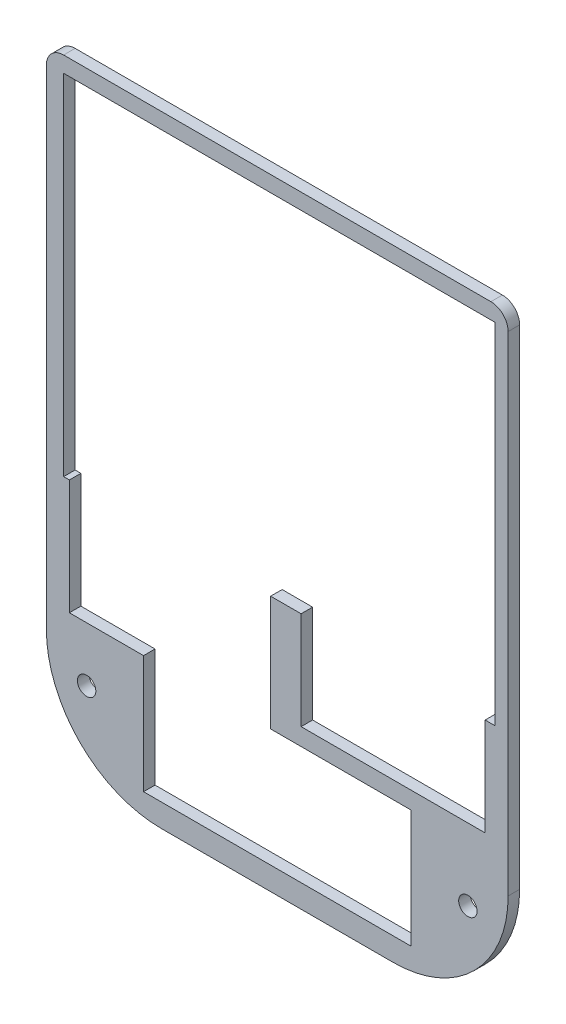
ISO-10303-21;
HEADER;
FILE_DESCRIPTION(('STEP AP214'),'2;1');
FILE_NAME('part.step','',(''),(''),'','','');
FILE_SCHEMA(('AUTOMOTIVE_DESIGN { 1 0 10303 214 1 1 1 1 }'));
ENDSEC;
DATA;
#1=APPLICATION_CONTEXT('core data for automotive mechanical design processes');
#2=APPLICATION_PROTOCOL_DEFINITION('international standard','automotive_design',2000,#1);
#3=PRODUCT_CONTEXT('',#1,'mechanical');
#4=PRODUCT('Part','Part','',(#3));
#5=PRODUCT_RELATED_PRODUCT_CATEGORY('part','',(#4));
#6=PRODUCT_DEFINITION_FORMATION('','',#4);
#7=PRODUCT_DEFINITION_CONTEXT('part definition',#1,'design');
#8=PRODUCT_DEFINITION('design','',#6,#7);
#9=PRODUCT_DEFINITION_SHAPE('','',#8);
#10=(LENGTH_UNIT() NAMED_UNIT(*) SI_UNIT(.MILLI.,.METRE.));
#11=(NAMED_UNIT(*) PLANE_ANGLE_UNIT() SI_UNIT($,.RADIAN.));
#12=(NAMED_UNIT(*) SI_UNIT($,.STERADIAN.) SOLID_ANGLE_UNIT());
#13=UNCERTAINTY_MEASURE_WITH_UNIT(LENGTH_MEASURE(1.E-05),#10,'distance_accuracy_value','');
#14=(GEOMETRIC_REPRESENTATION_CONTEXT(3) GLOBAL_UNCERTAINTY_ASSIGNED_CONTEXT((#13)) GLOBAL_UNIT_ASSIGNED_CONTEXT((#10,
#11,#12)) REPRESENTATION_CONTEXT('',''));
#15=CARTESIAN_POINT('',(0.,0.,0.));
#16=DIRECTION('',(0.,0.,1.));
#17=DIRECTION('',(1.,0.,0.));
#18=AXIS2_PLACEMENT_3D('',#15,#16,#17);
#19=CARTESIAN_POINT('',(0.,0.,2.));
#20=DIRECTION('',(0.,0.,-1.));
#21=DIRECTION('',(-1.,0.,0.));
#22=AXIS2_PLACEMENT_3D('',#19,#20,#21);
#23=PLANE('',#22);
#24=CARTESIAN_POINT('',(7.,-27.,2.));
#25=DIRECTION('',(0.,0.,1.));
#26=DIRECTION('',(1.,0.,0.));
#27=AXIS2_PLACEMENT_3D('',#24,#25,#26);
#28=CIRCLE('',#27,1.59999999999999);
#29=CARTESIAN_POINT('',(8.59999999999999,-27.,2.));
#30=VERTEX_POINT('',#29);
#31=EDGE_CURVE('E375',#30,#30,#28,.T.);
#32=ORIENTED_EDGE('',*,*,#31,.F.);
#33=EDGE_LOOP('',(#32));
#34=FACE_BOUND('',#33,.T.);
#35=CARTESIAN_POINT('',(73.3,-27.,2.));
#36=DIRECTION('',(0.,0.,1.));
#37=DIRECTION('',(1.,0.,0.));
#38=AXIS2_PLACEMENT_3D('',#35,#36,#37);
#39=CIRCLE('',#38,1.59999999999999);
#40=CARTESIAN_POINT('',(74.9,-27.,2.));
#41=VERTEX_POINT('',#40);
#42=EDGE_CURVE('E379',#41,#41,#39,.T.);
#43=ORIENTED_EDGE('',*,*,#42,.F.);
#44=EDGE_LOOP('',(#43));
#45=FACE_BOUND('',#44,.T.);
#46=DIRECTION('',(0.,-1.,0.));
#47=VECTOR('',#46,1.);
#48=CARTESIAN_POINT('',(0.,0.,2.));
#49=LINE('',#48,#47);
#50=CARTESIAN_POINT('',(0.,63.,2.));
#51=VERTEX_POINT('',#50);
#52=CARTESIAN_POINT('',(0.,-22.,2.));
#53=VERTEX_POINT('',#52);
#54=EDGE_CURVE('E390',#51,#53,#49,.T.);
#55=ORIENTED_EDGE('',*,*,#54,.T.);
#56=CARTESIAN_POINT('',(20.,-22.,2.));
#57=DIRECTION('',(0.,0.,-1.));
#58=DIRECTION('',(-1.,0.,0.));
#59=AXIS2_PLACEMENT_3D('',#56,#57,#58);
#60=CIRCLE('',#59,20.);
#61=CARTESIAN_POINT('',(20.,-42.,2.));
#62=VERTEX_POINT('',#61);
#63=EDGE_CURVE('E77',#53,#62,#60,.F.);
#64=ORIENTED_EDGE('',*,*,#63,.T.);
#65=DIRECTION('',(-1.,0.,0.));
#66=VECTOR('',#65,1.);
#67=CARTESIAN_POINT('',(80.3,-42.,2.));
#68=LINE('',#67,#66);
#69=CARTESIAN_POINT('',(60.3,-42.,2.));
#70=VERTEX_POINT('',#69);
#71=EDGE_CURVE('E386',#70,#62,#68,.T.);
#72=ORIENTED_EDGE('',*,*,#71,.F.);
#73=CARTESIAN_POINT('',(60.3,-22.,2.));
#74=DIRECTION('',(0.,0.,-1.));
#75=DIRECTION('',(-1.,0.,0.));
#76=AXIS2_PLACEMENT_3D('',#73,#74,#75);
#77=CIRCLE('',#76,20.);
#78=CARTESIAN_POINT('',(80.3,-22.,2.));
#79=VERTEX_POINT('',#78);
#80=EDGE_CURVE('E85',#70,#79,#77,.F.);
#81=ORIENTED_EDGE('',*,*,#80,.T.);
#82=DIRECTION('',(0.,1.,0.));
#83=VECTOR('',#82,1.);
#84=CARTESIAN_POINT('',(80.3,0.,2.));
#85=LINE('',#84,#83);
#86=CARTESIAN_POINT('',(80.3,63.,2.));
#87=VERTEX_POINT('',#86);
#88=EDGE_CURVE('E392',#79,#87,#85,.T.);
#89=ORIENTED_EDGE('',*,*,#88,.T.);
#90=CARTESIAN_POINT('',(77.3,63.,2.));
#91=DIRECTION('',(0.,0.,-1.));
#92=DIRECTION('',(-1.,0.,0.));
#93=AXIS2_PLACEMENT_3D('',#90,#91,#92);
#94=CIRCLE('',#93,3.);
#95=CARTESIAN_POINT('',(77.3,66.,2.));
#96=VERTEX_POINT('',#95);
#97=EDGE_CURVE('E418',#87,#96,#94,.F.);
#98=ORIENTED_EDGE('',*,*,#97,.T.);
#99=DIRECTION('',(-1.,0.,0.));
#100=VECTOR('',#99,1.);
#101=CARTESIAN_POINT('',(0.,66.,2.));
#102=LINE('',#101,#100);
#103=CARTESIAN_POINT('',(3.,66.,2.));
#104=VERTEX_POINT('',#103);
#105=EDGE_CURVE('E395',#96,#104,#102,.T.);
#106=ORIENTED_EDGE('',*,*,#105,.T.);
#107=CARTESIAN_POINT('',(3.,63.,2.));
#108=DIRECTION('',(0.,0.,-1.));
#109=DIRECTION('',(-1.,0.,0.));
#110=AXIS2_PLACEMENT_3D('',#107,#108,#109);
#111=CIRCLE('',#110,3.);
#112=EDGE_CURVE('E416',#104,#51,#111,.F.);
#113=ORIENTED_EDGE('',*,*,#112,.T.);
#114=EDGE_LOOP('',(#55,#64,#72,#81,#89,#98,#106,#113));
#115=FACE_BOUND('',#114,.T.);
#116=DIRECTION('',(0.,1.,0.));
#117=VECTOR('',#116,1.);
#118=CARTESIAN_POINT('',(78.,63.25,2.));
#119=LINE('',#118,#117);
#120=CARTESIAN_POINT('',(78.,2.50000000000001,2.));
#121=VERTEX_POINT('',#120);
#122=CARTESIAN_POINT('',(78.,63.25,2.));
#123=VERTEX_POINT('',#122);
#124=EDGE_CURVE('E285',#121,#123,#119,.T.);
#125=ORIENTED_EDGE('',*,*,#124,.F.);
#126=DIRECTION('',(1.,0.,0.));
#127=VECTOR('',#126,1.);
#128=CARTESIAN_POINT('',(3.00000000000001,2.50000000000001,2.));
#129=LINE('',#128,#127);
#130=CARTESIAN_POINT('',(76.3,2.50000000000001,2.));
#131=VERTEX_POINT('',#130);
#132=EDGE_CURVE('E269',#131,#121,#129,.T.);
#133=ORIENTED_EDGE('',*,*,#132,.F.);
#134=DIRECTION('',(0.,-1.,0.));
#135=VECTOR('',#134,1.);
#136=CARTESIAN_POINT('',(76.3,0.,2.));
#137=LINE('',#136,#135);
#138=CARTESIAN_POINT('',(76.3,-14.5,2.));
#139=VERTEX_POINT('',#138);
#140=EDGE_CURVE('E287',#131,#139,#137,.T.);
#141=ORIENTED_EDGE('',*,*,#140,.T.);
#142=DIRECTION('',(1.,0.,0.));
#143=VECTOR('',#142,1.);
#144=CARTESIAN_POINT('',(0.,-14.5,2.));
#145=LINE('',#144,#143);
#146=CARTESIAN_POINT('',(44.3,-14.5,2.));
#147=VERTEX_POINT('',#146);
#148=EDGE_CURVE('E294',#147,#139,#145,.T.);
#149=ORIENTED_EDGE('',*,*,#148,.F.);
#150=DIRECTION('',(0.,-1.,0.));
#151=VECTOR('',#150,1.);
#152=CARTESIAN_POINT('',(44.3,0.,2.));
#153=LINE('',#152,#151);
#154=CARTESIAN_POINT('',(44.3,2.5,2.));
#155=VERTEX_POINT('',#154);
#156=EDGE_CURVE('E288',#155,#147,#153,.T.);
#157=ORIENTED_EDGE('',*,*,#156,.F.);
#158=CARTESIAN_POINT('',(39.,2.50000000000001,2.));
#159=VERTEX_POINT('',#158);
#160=EDGE_CURVE('E268',#159,#155,#129,.T.);
#161=ORIENTED_EDGE('',*,*,#160,.F.);
#162=DIRECTION('',(0.,-1.,0.));
#163=VECTOR('',#162,1.);
#164=CARTESIAN_POINT('',(39.,0.,2.));
#165=LINE('',#164,#163);
#166=CARTESIAN_POINT('',(39.,-17.5,2.));
#167=VERTEX_POINT('',#166);
#168=EDGE_CURVE('E306',#159,#167,#165,.T.);
#169=ORIENTED_EDGE('',*,*,#168,.T.);
#170=DIRECTION('',(1.,0.,0.));
#171=VECTOR('',#170,1.);
#172=CARTESIAN_POINT('',(0.,-17.5,2.));
#173=LINE('',#172,#171);
#174=CARTESIAN_POINT('',(63.4,-17.5,2.));
#175=VERTEX_POINT('',#174);
#176=EDGE_CURVE('E316',#167,#175,#173,.T.);
#177=ORIENTED_EDGE('',*,*,#176,.T.);
#178=DIRECTION('',(0.,-1.,0.));
#179=VECTOR('',#178,1.);
#180=CARTESIAN_POINT('',(63.4,0.,2.));
#181=LINE('',#180,#179);
#182=CARTESIAN_POINT('',(63.4,-38.,2.));
#183=VERTEX_POINT('',#182);
#184=EDGE_CURVE('E346',#175,#183,#181,.T.);
#185=ORIENTED_EDGE('',*,*,#184,.T.);
#186=DIRECTION('',(1.,0.,0.));
#187=VECTOR('',#186,1.);
#188=CARTESIAN_POINT('',(0.,-38.,2.));
#189=LINE('',#188,#187);
#190=CARTESIAN_POINT('',(16.9,-38.,2.));
#191=VERTEX_POINT('',#190);
#192=EDGE_CURVE('E343',#191,#183,#189,.T.);
#193=ORIENTED_EDGE('',*,*,#192,.F.);
#194=DIRECTION('',(0.,-1.,0.));
#195=VECTOR('',#194,1.);
#196=CARTESIAN_POINT('',(16.9,0.,2.));
#197=LINE('',#196,#195);
#198=CARTESIAN_POINT('',(16.9,-17.5,2.));
#199=VERTEX_POINT('',#198);
#200=EDGE_CURVE('E340',#199,#191,#197,.T.);
#201=ORIENTED_EDGE('',*,*,#200,.F.);
#202=DIRECTION('',(1.,0.,0.));
#203=VECTOR('',#202,1.);
#204=CARTESIAN_POINT('',(0.,-17.5,2.));
#205=LINE('',#204,#203);
#206=CARTESIAN_POINT('',(4.,-17.5,2.));
#207=VERTEX_POINT('',#206);
#208=EDGE_CURVE('E337',#207,#199,#205,.T.);
#209=ORIENTED_EDGE('',*,*,#208,.F.);
#210=DIRECTION('',(0.,-1.,0.));
#211=VECTOR('',#210,1.);
#212=CARTESIAN_POINT('',(4.,0.,2.));
#213=LINE('',#212,#211);
#214=CARTESIAN_POINT('',(4.,2.5,2.));
#215=VERTEX_POINT('',#214);
#216=EDGE_CURVE('E334',#215,#207,#213,.T.);
#217=ORIENTED_EDGE('',*,*,#216,.F.);
#218=CARTESIAN_POINT('',(3.00000000000001,2.50000000000001,2.));
#219=VERTEX_POINT('',#218);
#220=EDGE_CURVE('E266',#219,#215,#129,.T.);
#221=ORIENTED_EDGE('',*,*,#220,.F.);
#222=DIRECTION('',(0.,-1.,0.));
#223=VECTOR('',#222,1.);
#224=CARTESIAN_POINT('',(3.00000000000001,63.25,2.));
#225=LINE('',#224,#223);
#226=CARTESIAN_POINT('',(3.00000000000001,63.25,2.));
#227=VERTEX_POINT('',#226);
#228=EDGE_CURVE('E253',#227,#219,#225,.T.);
#229=ORIENTED_EDGE('',*,*,#228,.F.);
#230=DIRECTION('',(-1.,0.,0.));
#231=VECTOR('',#230,1.);
#232=CARTESIAN_POINT('',(3.00000000000001,63.25,2.));
#233=LINE('',#232,#231);
#234=EDGE_CURVE('E247',#123,#227,#233,.T.);
#235=ORIENTED_EDGE('',*,*,#234,.F.);
#236=EDGE_LOOP('',(#125,#133,#141,#149,#157,#161,#169,#177,#185,#193,#201,#209,#217,#221,#229,#235));
#237=FACE_BOUND('',#236,.T.);
#238=ADVANCED_FACE('F68',(#34,#45,#115,#237),#23,.F.);
#239=CARTESIAN_POINT('',(0.,0.,0.));
#240=DIRECTION('',(0.,0.,-1.));
#241=DIRECTION('',(-1.,0.,0.));
#242=AXIS2_PLACEMENT_3D('',#239,#240,#241);
#243=PLANE('',#242);
#244=DIRECTION('',(1.,0.,0.));
#245=VECTOR('',#244,1.);
#246=CARTESIAN_POINT('',(3.00000000000001,2.50000000000001,0.));
#247=LINE('',#246,#245);
#248=CARTESIAN_POINT('',(76.3,2.50000000000001,0.));
#249=VERTEX_POINT('',#248);
#250=CARTESIAN_POINT('',(78.,2.50000000000001,0.));
#251=VERTEX_POINT('',#250);
#252=EDGE_CURVE('E263',#249,#251,#247,.T.);
#253=ORIENTED_EDGE('',*,*,#252,.T.);
#254=DIRECTION('',(0.,1.,0.));
#255=VECTOR('',#254,1.);
#256=CARTESIAN_POINT('',(78.,63.25,0.));
#257=LINE('',#256,#255);
#258=CARTESIAN_POINT('',(78.,63.25,0.));
#259=VERTEX_POINT('',#258);
#260=EDGE_CURVE('E246',#251,#259,#257,.T.);
#261=ORIENTED_EDGE('',*,*,#260,.T.);
#262=DIRECTION('',(-1.,0.,0.));
#263=VECTOR('',#262,1.);
#264=CARTESIAN_POINT('',(3.00000000000001,63.25,0.));
#265=LINE('',#264,#263);
#266=CARTESIAN_POINT('',(3.00000000000001,63.25,0.));
#267=VERTEX_POINT('',#266);
#268=EDGE_CURVE('E244',#259,#267,#265,.T.);
#269=ORIENTED_EDGE('',*,*,#268,.T.);
#270=DIRECTION('',(0.,-1.,0.));
#271=VECTOR('',#270,1.);
#272=CARTESIAN_POINT('',(3.00000000000001,63.25,0.));
#273=LINE('',#272,#271);
#274=CARTESIAN_POINT('',(3.00000000000001,2.50000000000001,0.));
#275=VERTEX_POINT('',#274);
#276=EDGE_CURVE('E233',#267,#275,#273,.T.);
#277=ORIENTED_EDGE('',*,*,#276,.T.);
#278=CARTESIAN_POINT('',(4.,2.50000000000001,0.));
#279=VERTEX_POINT('',#278);
#280=EDGE_CURVE('E240',#275,#279,#247,.T.);
#281=ORIENTED_EDGE('',*,*,#280,.T.);
#282=DIRECTION('',(0.,-1.,0.));
#283=VECTOR('',#282,1.);
#284=CARTESIAN_POINT('',(4.,0.,0.));
#285=LINE('',#284,#283);
#286=CARTESIAN_POINT('',(4.,-17.5,0.));
#287=VERTEX_POINT('',#286);
#288=EDGE_CURVE('E315',#279,#287,#285,.T.);
#289=ORIENTED_EDGE('',*,*,#288,.T.);
#290=DIRECTION('',(1.,0.,0.));
#291=VECTOR('',#290,1.);
#292=CARTESIAN_POINT('',(0.,-17.5,0.));
#293=LINE('',#292,#291);
#294=CARTESIAN_POINT('',(16.9,-17.5,0.));
#295=VERTEX_POINT('',#294);
#296=EDGE_CURVE('E318',#287,#295,#293,.T.);
#297=ORIENTED_EDGE('',*,*,#296,.T.);
#298=DIRECTION('',(0.,-1.,0.));
#299=VECTOR('',#298,1.);
#300=CARTESIAN_POINT('',(16.9,0.,0.));
#301=LINE('',#300,#299);
#302=CARTESIAN_POINT('',(16.9,-38.,0.));
#303=VERTEX_POINT('',#302);
#304=EDGE_CURVE('E321',#295,#303,#301,.T.);
#305=ORIENTED_EDGE('',*,*,#304,.T.);
#306=DIRECTION('',(1.,0.,0.));
#307=VECTOR('',#306,1.);
#308=CARTESIAN_POINT('',(0.,-38.,0.));
#309=LINE('',#308,#307);
#310=CARTESIAN_POINT('',(63.4,-38.,0.));
#311=VERTEX_POINT('',#310);
#312=EDGE_CURVE('E324',#303,#311,#309,.T.);
#313=ORIENTED_EDGE('',*,*,#312,.T.);
#314=DIRECTION('',(0.,-1.,0.));
#315=VECTOR('',#314,1.);
#316=CARTESIAN_POINT('',(63.4,0.,0.));
#317=LINE('',#316,#315);
#318=CARTESIAN_POINT('',(63.4,-17.5,0.));
#319=VERTEX_POINT('',#318);
#320=EDGE_CURVE('E327',#319,#311,#317,.T.);
#321=ORIENTED_EDGE('',*,*,#320,.F.);
#322=DIRECTION('',(1.,0.,0.));
#323=VECTOR('',#322,1.);
#324=CARTESIAN_POINT('',(0.,-17.5,0.));
#325=LINE('',#324,#323);
#326=CARTESIAN_POINT('',(39.,-17.5,0.));
#327=VERTEX_POINT('',#326);
#328=EDGE_CURVE('E329',#327,#319,#325,.T.);
#329=ORIENTED_EDGE('',*,*,#328,.F.);
#330=DIRECTION('',(0.,-1.,0.));
#331=VECTOR('',#330,1.);
#332=CARTESIAN_POINT('',(39.,0.,0.));
#333=LINE('',#332,#331);
#334=CARTESIAN_POINT('',(39.,2.50000000000001,0.));
#335=VERTEX_POINT('',#334);
#336=EDGE_CURVE('E313',#335,#327,#333,.T.);
#337=ORIENTED_EDGE('',*,*,#336,.F.);
#338=CARTESIAN_POINT('',(44.3,2.50000000000001,0.));
#339=VERTEX_POINT('',#338);
#340=EDGE_CURVE('E261',#335,#339,#247,.T.);
#341=ORIENTED_EDGE('',*,*,#340,.T.);
#342=DIRECTION('',(0.,-1.,0.));
#343=VECTOR('',#342,1.);
#344=CARTESIAN_POINT('',(44.3,0.,0.));
#345=LINE('',#344,#343);
#346=CARTESIAN_POINT('',(44.3,-14.5,0.));
#347=VERTEX_POINT('',#346);
#348=EDGE_CURVE('E293',#339,#347,#345,.T.);
#349=ORIENTED_EDGE('',*,*,#348,.T.);
#350=DIRECTION('',(1.,0.,0.));
#351=VECTOR('',#350,1.);
#352=CARTESIAN_POINT('',(0.,-14.5,0.));
#353=LINE('',#352,#351);
#354=CARTESIAN_POINT('',(76.3,-14.5,0.));
#355=VERTEX_POINT('',#354);
#356=EDGE_CURVE('E297',#347,#355,#353,.T.);
#357=ORIENTED_EDGE('',*,*,#356,.T.);
#358=DIRECTION('',(0.,-1.,0.));
#359=VECTOR('',#358,1.);
#360=CARTESIAN_POINT('',(76.3,0.,0.));
#361=LINE('',#360,#359);
#362=EDGE_CURVE('E291',#249,#355,#361,.T.);
#363=ORIENTED_EDGE('',*,*,#362,.F.);
#364=EDGE_LOOP('',(#253,#261,#269,#277,#281,#289,#297,#305,#313,#321,#329,#337,#341,#349,#357,#363));
#365=FACE_BOUND('',#364,.T.);
#366=CARTESIAN_POINT('',(7.,-27.,0.));
#367=DIRECTION('',(0.,0.,-1.));
#368=DIRECTION('',(-1.,0.,0.));
#369=AXIS2_PLACEMENT_3D('',#366,#367,#368);
#370=CIRCLE('',#369,1.59999999999999);
#371=CARTESIAN_POINT('',(5.40000000000002,-27.,0.));
#372=VERTEX_POINT('',#371);
#373=EDGE_CURVE('E72',#372,#372,#370,.T.);
#374=ORIENTED_EDGE('',*,*,#373,.F.);
#375=EDGE_LOOP('',(#374));
#376=FACE_BOUND('',#375,.T.);
#377=CARTESIAN_POINT('',(73.3,-27.,0.));
#378=DIRECTION('',(0.,0.,-1.));
#379=DIRECTION('',(-1.,0.,0.));
#380=AXIS2_PLACEMENT_3D('',#377,#378,#379);
#381=CIRCLE('',#380,1.59999999999998);
#382=CARTESIAN_POINT('',(71.7,-27.,0.));
#383=VERTEX_POINT('',#382);
#384=EDGE_CURVE('E382',#383,#383,#381,.T.);
#385=ORIENTED_EDGE('',*,*,#384,.F.);
#386=EDGE_LOOP('',(#385));
#387=FACE_BOUND('',#386,.T.);
#388=DIRECTION('',(1.,0.,0.));
#389=VECTOR('',#388,1.);
#390=CARTESIAN_POINT('',(0.,-42.,0.));
#391=LINE('',#390,#389);
#392=CARTESIAN_POINT('',(20.,-42.,0.));
#393=VERTEX_POINT('',#392);
#394=CARTESIAN_POINT('',(60.3,-42.,0.));
#395=VERTEX_POINT('',#394);
#396=EDGE_CURVE('E383',#393,#395,#391,.T.);
#397=ORIENTED_EDGE('',*,*,#396,.F.);
#398=CARTESIAN_POINT('',(20.,-22.,0.));
#399=DIRECTION('',(0.,0.,-1.));
#400=DIRECTION('',(-1.,0.,0.));
#401=AXIS2_PLACEMENT_3D('',#398,#399,#400);
#402=CIRCLE('',#401,20.);
#403=CARTESIAN_POINT('',(0.,-22.,0.));
#404=VERTEX_POINT('',#403);
#405=EDGE_CURVE('E431',#393,#404,#402,.T.);
#406=ORIENTED_EDGE('',*,*,#405,.T.);
#407=DIRECTION('',(0.,-1.,0.));
#408=VECTOR('',#407,1.);
#409=CARTESIAN_POINT('',(0.,0.,0.));
#410=LINE('',#409,#408);
#411=CARTESIAN_POINT('',(0.,63.,0.));
#412=VERTEX_POINT('',#411);
#413=EDGE_CURVE('E389',#412,#404,#410,.T.);
#414=ORIENTED_EDGE('',*,*,#413,.F.);
#415=CARTESIAN_POINT('',(3.,63.,0.));
#416=DIRECTION('',(0.,0.,-1.));
#417=DIRECTION('',(-1.,0.,0.));
#418=AXIS2_PLACEMENT_3D('',#415,#416,#417);
#419=CIRCLE('',#418,3.);
#420=CARTESIAN_POINT('',(3.,66.,0.));
#421=VERTEX_POINT('',#420);
#422=EDGE_CURVE('E408',#412,#421,#419,.T.);
#423=ORIENTED_EDGE('',*,*,#422,.T.);
#424=DIRECTION('',(-1.,0.,0.));
#425=VECTOR('',#424,1.);
#426=CARTESIAN_POINT('',(0.,66.,0.));
#427=LINE('',#426,#425);
#428=CARTESIAN_POINT('',(77.3,66.,0.));
#429=VERTEX_POINT('',#428);
#430=EDGE_CURVE('E393',#429,#421,#427,.T.);
#431=ORIENTED_EDGE('',*,*,#430,.F.);
#432=CARTESIAN_POINT('',(77.3,63.,0.));
#433=DIRECTION('',(0.,0.,-1.));
#434=DIRECTION('',(-1.,0.,0.));
#435=AXIS2_PLACEMENT_3D('',#432,#433,#434);
#436=CIRCLE('',#435,3.);
#437=CARTESIAN_POINT('',(80.3,63.,0.));
#438=VERTEX_POINT('',#437);
#439=EDGE_CURVE('E410',#429,#438,#436,.T.);
#440=ORIENTED_EDGE('',*,*,#439,.T.);
#441=DIRECTION('',(0.,1.,0.));
#442=VECTOR('',#441,1.);
#443=CARTESIAN_POINT('',(80.3,0.,0.));
#444=LINE('',#443,#442);
#445=CARTESIAN_POINT('',(80.3,-22.,0.));
#446=VERTEX_POINT('',#445);
#447=EDGE_CURVE('E400',#446,#438,#444,.T.);
#448=ORIENTED_EDGE('',*,*,#447,.F.);
#449=CARTESIAN_POINT('',(60.3,-22.,0.));
#450=DIRECTION('',(0.,0.,-1.));
#451=DIRECTION('',(-1.,0.,0.));
#452=AXIS2_PLACEMENT_3D('',#449,#450,#451);
#453=CIRCLE('',#452,20.);
#454=EDGE_CURVE('E429',#446,#395,#453,.T.);
#455=ORIENTED_EDGE('',*,*,#454,.T.);
#456=EDGE_LOOP('',(#397,#406,#414,#423,#431,#440,#448,#455));
#457=FACE_BOUND('',#456,.T.);
#458=ADVANCED_FACE('F236',(#365,#376,#387,#457),#243,.T.);
#459=CARTESIAN_POINT('',(0.,0.,2.));
#460=DIRECTION('',(1.,0.,0.));
#461=DIRECTION('',(0.,0.,-1.));
#462=AXIS2_PLACEMENT_3D('',#459,#460,#461);
#463=PLANE('',#462);
#464=ORIENTED_EDGE('',*,*,#413,.T.);
#465=DIRECTION('',(0.,0.,-1.));
#466=VECTOR('',#465,1.);
#467=CARTESIAN_POINT('',(0.,-22.,2.));
#468=LINE('',#467,#466);
#469=EDGE_CURVE('E93',#404,#53,#468,.F.);
#470=ORIENTED_EDGE('',*,*,#469,.T.);
#471=ORIENTED_EDGE('',*,*,#54,.F.);
#472=DIRECTION('',(0.,0.,-1.));
#473=VECTOR('',#472,1.);
#474=CARTESIAN_POINT('',(0.,63.,2.));
#475=LINE('',#474,#473);
#476=EDGE_CURVE('E420',#51,#412,#475,.T.);
#477=ORIENTED_EDGE('',*,*,#476,.T.);
#478=EDGE_LOOP('',(#464,#470,#471,#477));
#479=FACE_BOUND('',#478,.T.);
#480=ADVANCED_FACE('F443',(#479),#463,.F.);
#481=CARTESIAN_POINT('',(80.3,0.,2.));
#482=DIRECTION('',(-1.,0.,0.));
#483=DIRECTION('',(0.,0.,1.));
#484=AXIS2_PLACEMENT_3D('',#481,#482,#483);
#485=PLANE('',#484);
#486=ORIENTED_EDGE('',*,*,#88,.F.);
#487=DIRECTION('',(0.,0.,1.));
#488=VECTOR('',#487,1.);
#489=CARTESIAN_POINT('',(80.3,-22.,0.));
#490=LINE('',#489,#488);
#491=EDGE_CURVE('E12',#79,#446,#490,.F.);
#492=ORIENTED_EDGE('',*,*,#491,.T.);
#493=ORIENTED_EDGE('',*,*,#447,.T.);
#494=DIRECTION('',(0.,0.,-1.));
#495=VECTOR('',#494,1.);
#496=CARTESIAN_POINT('',(80.3,63.,2.));
#497=LINE('',#496,#495);
#498=EDGE_CURVE('E413',#438,#87,#497,.F.);
#499=ORIENTED_EDGE('',*,*,#498,.T.);
#500=EDGE_LOOP('',(#486,#492,#493,#499));
#501=FACE_BOUND('',#500,.T.);
#502=ADVANCED_FACE('F456',(#501),#485,.F.);
#503=CARTESIAN_POINT('',(0.,66.,2.));
#504=DIRECTION('',(0.,-1.,0.));
#505=DIRECTION('',(0.,0.,-1.));
#506=AXIS2_PLACEMENT_3D('',#503,#504,#505);
#507=PLANE('',#506);
#508=ORIENTED_EDGE('',*,*,#105,.F.);
#509=DIRECTION('',(0.,0.,-1.));
#510=VECTOR('',#509,1.);
#511=CARTESIAN_POINT('',(77.3,66.,2.));
#512=LINE('',#511,#510);
#513=EDGE_CURVE('E405',#96,#429,#512,.T.);
#514=ORIENTED_EDGE('',*,*,#513,.T.);
#515=ORIENTED_EDGE('',*,*,#430,.T.);
#516=DIRECTION('',(0.,0.,-1.));
#517=VECTOR('',#516,1.);
#518=CARTESIAN_POINT('',(3.,66.,2.));
#519=LINE('',#518,#517);
#520=EDGE_CURVE('E398',#421,#104,#519,.F.);
#521=ORIENTED_EDGE('',*,*,#520,.T.);
#522=EDGE_LOOP('',(#508,#514,#515,#521));
#523=FACE_BOUND('',#522,.T.);
#524=ADVANCED_FACE('F466',(#523),#507,.F.);
#525=CARTESIAN_POINT('',(77.3,63.,2.));
#526=DIRECTION('',(0.,0.,-1.));
#527=DIRECTION('',(-1.,0.,0.));
#528=AXIS2_PLACEMENT_3D('',#525,#526,#527);
#529=CYLINDRICAL_SURFACE('',#528,3.);
#530=ORIENTED_EDGE('',*,*,#97,.F.);
#531=ORIENTED_EDGE('',*,*,#498,.F.);
#532=ORIENTED_EDGE('',*,*,#439,.F.);
#533=ORIENTED_EDGE('',*,*,#513,.F.);
#534=EDGE_LOOP('',(#530,#531,#532,#533));
#535=FACE_BOUND('',#534,.T.);
#536=ADVANCED_FACE('F462',(#535),#529,.T.);
#537=CARTESIAN_POINT('',(3.,63.,2.));
#538=DIRECTION('',(0.,0.,-1.));
#539=DIRECTION('',(-1.,0.,0.));
#540=AXIS2_PLACEMENT_3D('',#537,#538,#539);
#541=CYLINDRICAL_SURFACE('',#540,3.);
#542=ORIENTED_EDGE('',*,*,#112,.F.);
#543=ORIENTED_EDGE('',*,*,#520,.F.);
#544=ORIENTED_EDGE('',*,*,#422,.F.);
#545=ORIENTED_EDGE('',*,*,#476,.F.);
#546=EDGE_LOOP('',(#542,#543,#544,#545));
#547=FACE_BOUND('',#546,.T.);
#548=ADVANCED_FACE('F469',(#547),#541,.T.);
#549=CARTESIAN_POINT('',(0.,-42.,0.));
#550=DIRECTION('',(0.,-1.,0.));
#551=DIRECTION('',(0.,0.,-1.));
#552=AXIS2_PLACEMENT_3D('',#549,#550,#551);
#553=PLANE('',#552);
#554=ORIENTED_EDGE('',*,*,#71,.T.);
#555=DIRECTION('',(0.,0.,-1.));
#556=VECTOR('',#555,1.);
#557=CARTESIAN_POINT('',(20.,-42.,0.));
#558=LINE('',#557,#556);
#559=EDGE_CURVE('E426',#62,#393,#558,.T.);
#560=ORIENTED_EDGE('',*,*,#559,.T.);
#561=ORIENTED_EDGE('',*,*,#396,.T.);
#562=DIRECTION('',(0.,0.,1.));
#563=VECTOR('',#562,1.);
#564=CARTESIAN_POINT('',(60.3,-42.,2.));
#565=LINE('',#564,#563);
#566=EDGE_CURVE('E423',#395,#70,#565,.T.);
#567=ORIENTED_EDGE('',*,*,#566,.T.);
#568=EDGE_LOOP('',(#554,#560,#561,#567));
#569=FACE_BOUND('',#568,.T.);
#570=ADVANCED_FACE('F451',(#569),#553,.T.);
#571=CARTESIAN_POINT('',(20.,-22.,0.));
#572=DIRECTION('',(0.,0.,1.));
#573=DIRECTION('',(1.,0.,0.));
#574=AXIS2_PLACEMENT_3D('',#571,#572,#573);
#575=CYLINDRICAL_SURFACE('',#574,20.);
#576=ORIENTED_EDGE('',*,*,#63,.F.);
#577=ORIENTED_EDGE('',*,*,#469,.F.);
#578=ORIENTED_EDGE('',*,*,#405,.F.);
#579=ORIENTED_EDGE('',*,*,#559,.F.);
#580=EDGE_LOOP('',(#576,#577,#578,#579));
#581=FACE_BOUND('',#580,.T.);
#582=ADVANCED_FACE('F473',(#581),#575,.T.);
#583=CARTESIAN_POINT('',(60.3,-22.,0.));
#584=DIRECTION('',(0.,0.,-1.));
#585=DIRECTION('',(-1.,0.,0.));
#586=AXIS2_PLACEMENT_3D('',#583,#584,#585);
#587=CYLINDRICAL_SURFACE('',#586,20.);
#588=ORIENTED_EDGE('',*,*,#454,.F.);
#589=ORIENTED_EDGE('',*,*,#491,.F.);
#590=ORIENTED_EDGE('',*,*,#80,.F.);
#591=ORIENTED_EDGE('',*,*,#566,.F.);
#592=EDGE_LOOP('',(#588,#589,#590,#591));
#593=FACE_BOUND('',#592,.T.);
#594=ADVANCED_FACE('F70',(#593),#587,.T.);
#595=CARTESIAN_POINT('',(73.3,-27.,2.));
#596=DIRECTION('',(0.,0.,1.));
#597=DIRECTION('',(1.,0.,0.));
#598=AXIS2_PLACEMENT_3D('',#595,#596,#597);
#599=CYLINDRICAL_SURFACE('',#598,1.59999999999998);
#600=ORIENTED_EDGE('',*,*,#384,.T.);
#601=EDGE_LOOP('',(#600));
#602=FACE_BOUND('',#601,.T.);
#603=ORIENTED_EDGE('',*,*,#42,.T.);
#604=EDGE_LOOP('',(#603));
#605=FACE_BOUND('',#604,.T.);
#606=ADVANCED_FACE('F438',(#602,#605),#599,.F.);
#607=CARTESIAN_POINT('',(7.,-27.,2.));
#608=DIRECTION('',(0.,0.,1.));
#609=DIRECTION('',(1.,0.,0.));
#610=AXIS2_PLACEMENT_3D('',#607,#608,#609);
#611=CYLINDRICAL_SURFACE('',#610,1.59999999999999);
#612=ORIENTED_EDGE('',*,*,#373,.T.);
#613=EDGE_LOOP('',(#612));
#614=FACE_BOUND('',#613,.T.);
#615=ORIENTED_EDGE('',*,*,#31,.T.);
#616=EDGE_LOOP('',(#615));
#617=FACE_BOUND('',#616,.T.);
#618=ADVANCED_FACE('F529',(#614,#617),#611,.F.);
#619=CARTESIAN_POINT('',(3.00000000000001,63.25,0.));
#620=DIRECTION('',(-1.,0.,0.));
#621=DIRECTION('',(0.,0.,1.));
#622=AXIS2_PLACEMENT_3D('',#619,#620,#621);
#623=PLANE('',#622);
#624=ORIENTED_EDGE('',*,*,#228,.T.);
#625=DIRECTION('',(0.,0.,1.));
#626=VECTOR('',#625,1.);
#627=CARTESIAN_POINT('',(3.00000000000001,2.50000000000001,0.));
#628=LINE('',#627,#626);
#629=EDGE_CURVE('E250',#275,#219,#628,.T.);
#630=ORIENTED_EDGE('',*,*,#629,.F.);
#631=ORIENTED_EDGE('',*,*,#276,.F.);
#632=DIRECTION('',(0.,0.,1.));
#633=VECTOR('',#632,1.);
#634=CARTESIAN_POINT('',(3.00000000000001,63.25,0.));
#635=LINE('',#634,#633);
#636=EDGE_CURVE('E373',#267,#227,#635,.T.);
#637=ORIENTED_EDGE('',*,*,#636,.T.);
#638=EDGE_LOOP('',(#624,#630,#631,#637));
#639=FACE_BOUND('',#638,.T.);
#640=ADVANCED_FACE('F251',(#639),#623,.F.);
#641=CARTESIAN_POINT('',(3.00000000000001,63.25,0.));
#642=DIRECTION('',(0.,1.,0.));
#643=DIRECTION('',(0.,0.,1.));
#644=AXIS2_PLACEMENT_3D('',#641,#642,#643);
#645=PLANE('',#644);
#646=ORIENTED_EDGE('',*,*,#234,.T.);
#647=ORIENTED_EDGE('',*,*,#636,.F.);
#648=ORIENTED_EDGE('',*,*,#268,.F.);
#649=DIRECTION('',(0.,0.,1.));
#650=VECTOR('',#649,1.);
#651=CARTESIAN_POINT('',(78.,63.25,0.));
#652=LINE('',#651,#650);
#653=EDGE_CURVE('E368',#259,#123,#652,.T.);
#654=ORIENTED_EDGE('',*,*,#653,.T.);
#655=EDGE_LOOP('',(#646,#647,#648,#654));
#656=FACE_BOUND('',#655,.T.);
#657=ADVANCED_FACE('F544',(#656),#645,.F.);
#658=CARTESIAN_POINT('',(78.,63.25,0.));
#659=DIRECTION('',(1.,0.,0.));
#660=DIRECTION('',(0.,0.,-1.));
#661=AXIS2_PLACEMENT_3D('',#658,#659,#660);
#662=PLANE('',#661);
#663=ORIENTED_EDGE('',*,*,#124,.T.);
#664=ORIENTED_EDGE('',*,*,#653,.F.);
#665=ORIENTED_EDGE('',*,*,#260,.F.);
#666=DIRECTION('',(0.,0.,1.));
#667=VECTOR('',#666,1.);
#668=CARTESIAN_POINT('',(78.,2.50000000000001,0.));
#669=LINE('',#668,#667);
#670=EDGE_CURVE('E256',#251,#121,#669,.T.);
#671=ORIENTED_EDGE('',*,*,#670,.T.);
#672=EDGE_LOOP('',(#663,#664,#665,#671));
#673=FACE_BOUND('',#672,.T.);
#674=ADVANCED_FACE('F284',(#673),#662,.F.);
#675=CARTESIAN_POINT('',(39.,0.,0.));
#676=DIRECTION('',(-1.,0.,0.));
#677=DIRECTION('',(0.,0.,1.));
#678=AXIS2_PLACEMENT_3D('',#675,#676,#677);
#679=PLANE('',#678);
#680=ORIENTED_EDGE('',*,*,#168,.F.);
#681=DIRECTION('',(0.,0.,1.));
#682=VECTOR('',#681,1.);
#683=CARTESIAN_POINT('',(39.,2.5,0.));
#684=LINE('',#683,#682);
#685=EDGE_CURVE('E331',#335,#159,#684,.T.);
#686=ORIENTED_EDGE('',*,*,#685,.F.);
#687=ORIENTED_EDGE('',*,*,#336,.T.);
#688=DIRECTION('',(0.,0.,1.));
#689=VECTOR('',#688,1.);
#690=CARTESIAN_POINT('',(39.,-17.5,0.));
#691=LINE('',#690,#689);
#692=EDGE_CURVE('E351',#327,#167,#691,.T.);
#693=ORIENTED_EDGE('',*,*,#692,.T.);
#694=EDGE_LOOP('',(#680,#686,#687,#693));
#695=FACE_BOUND('',#694,.T.);
#696=ADVANCED_FACE('F562',(#695),#679,.T.);
#697=CARTESIAN_POINT('',(0.,-17.5,0.));
#698=DIRECTION('',(0.,-1.,0.));
#699=DIRECTION('',(1.,0.,0.));
#700=AXIS2_PLACEMENT_3D('',#697,#698,#699);
#701=PLANE('',#700);
#702=ORIENTED_EDGE('',*,*,#176,.F.);
#703=ORIENTED_EDGE('',*,*,#692,.F.);
#704=ORIENTED_EDGE('',*,*,#328,.T.);
#705=DIRECTION('',(0.,0.,1.));
#706=VECTOR('',#705,1.);
#707=CARTESIAN_POINT('',(63.4,-17.5,0.));
#708=LINE('',#707,#706);
#709=EDGE_CURVE('E354',#319,#175,#708,.T.);
#710=ORIENTED_EDGE('',*,*,#709,.T.);
#711=EDGE_LOOP('',(#702,#703,#704,#710));
#712=FACE_BOUND('',#711,.T.);
#713=ADVANCED_FACE('F556',(#712),#701,.T.);
#714=CARTESIAN_POINT('',(63.4,0.,0.));
#715=DIRECTION('',(-1.,0.,0.));
#716=DIRECTION('',(0.,0.,1.));
#717=AXIS2_PLACEMENT_3D('',#714,#715,#716);
#718=PLANE('',#717);
#719=ORIENTED_EDGE('',*,*,#184,.F.);
#720=ORIENTED_EDGE('',*,*,#709,.F.);
#721=ORIENTED_EDGE('',*,*,#320,.T.);
#722=DIRECTION('',(0.,0.,1.));
#723=VECTOR('',#722,1.);
#724=CARTESIAN_POINT('',(63.4,-38.,0.));
#725=LINE('',#724,#723);
#726=EDGE_CURVE('E356',#311,#183,#725,.T.);
#727=ORIENTED_EDGE('',*,*,#726,.T.);
#728=EDGE_LOOP('',(#719,#720,#721,#727));
#729=FACE_BOUND('',#728,.T.);
#730=ADVANCED_FACE('F561',(#729),#718,.T.);
#731=CARTESIAN_POINT('',(0.,-38.,0.));
#732=DIRECTION('',(0.,-1.,0.));
#733=DIRECTION('',(1.,0.,0.));
#734=AXIS2_PLACEMENT_3D('',#731,#732,#733);
#735=PLANE('',#734);
#736=ORIENTED_EDGE('',*,*,#192,.T.);
#737=ORIENTED_EDGE('',*,*,#726,.F.);
#738=ORIENTED_EDGE('',*,*,#312,.F.);
#739=DIRECTION('',(0.,0.,1.));
#740=VECTOR('',#739,1.);
#741=CARTESIAN_POINT('',(16.9,-38.,0.));
#742=LINE('',#741,#740);
#743=EDGE_CURVE('E358',#303,#191,#742,.T.);
#744=ORIENTED_EDGE('',*,*,#743,.T.);
#745=EDGE_LOOP('',(#736,#737,#738,#744));
#746=FACE_BOUND('',#745,.T.);
#747=ADVANCED_FACE('F574',(#746),#735,.F.);
#748=CARTESIAN_POINT('',(16.9,0.,0.));
#749=DIRECTION('',(-1.,0.,0.));
#750=DIRECTION('',(0.,0.,1.));
#751=AXIS2_PLACEMENT_3D('',#748,#749,#750);
#752=PLANE('',#751);
#753=ORIENTED_EDGE('',*,*,#200,.T.);
#754=ORIENTED_EDGE('',*,*,#743,.F.);
#755=ORIENTED_EDGE('',*,*,#304,.F.);
#756=DIRECTION('',(0.,0.,1.));
#757=VECTOR('',#756,1.);
#758=CARTESIAN_POINT('',(16.9,-17.5,0.));
#759=LINE('',#758,#757);
#760=EDGE_CURVE('E360',#295,#199,#759,.T.);
#761=ORIENTED_EDGE('',*,*,#760,.T.);
#762=EDGE_LOOP('',(#753,#754,#755,#761));
#763=FACE_BOUND('',#762,.T.);
#764=ADVANCED_FACE('F584',(#763),#752,.F.);
#765=CARTESIAN_POINT('',(0.,-17.5,0.));
#766=DIRECTION('',(0.,-1.,0.));
#767=DIRECTION('',(0.,0.,-1.));
#768=AXIS2_PLACEMENT_3D('',#765,#766,#767);
#769=PLANE('',#768);
#770=ORIENTED_EDGE('',*,*,#208,.T.);
#771=ORIENTED_EDGE('',*,*,#760,.F.);
#772=ORIENTED_EDGE('',*,*,#296,.F.);
#773=DIRECTION('',(0.,0.,1.));
#774=VECTOR('',#773,1.);
#775=CARTESIAN_POINT('',(4.,-17.5,0.));
#776=LINE('',#775,#774);
#777=EDGE_CURVE('E362',#287,#207,#776,.T.);
#778=ORIENTED_EDGE('',*,*,#777,.T.);
#779=EDGE_LOOP('',(#770,#771,#772,#778));
#780=FACE_BOUND('',#779,.T.);
#781=ADVANCED_FACE('F594',(#780),#769,.F.);
#782=CARTESIAN_POINT('',(4.,0.,0.));
#783=DIRECTION('',(-1.,0.,0.));
#784=DIRECTION('',(0.,0.,1.));
#785=AXIS2_PLACEMENT_3D('',#782,#783,#784);
#786=PLANE('',#785);
#787=ORIENTED_EDGE('',*,*,#216,.T.);
#788=ORIENTED_EDGE('',*,*,#777,.F.);
#789=ORIENTED_EDGE('',*,*,#288,.F.);
#790=DIRECTION('',(0.,0.,1.));
#791=VECTOR('',#790,1.);
#792=CARTESIAN_POINT('',(4.,2.5,0.));
#793=LINE('',#792,#791);
#794=EDGE_CURVE('E260',#279,#215,#793,.T.);
#795=ORIENTED_EDGE('',*,*,#794,.T.);
#796=EDGE_LOOP('',(#787,#788,#789,#795));
#797=FACE_BOUND('',#796,.T.);
#798=ADVANCED_FACE('F605',(#797),#786,.F.);
#799=CARTESIAN_POINT('',(76.3,0.,0.));
#800=DIRECTION('',(-1.,0.,0.));
#801=DIRECTION('',(0.,0.,1.));
#802=AXIS2_PLACEMENT_3D('',#799,#800,#801);
#803=PLANE('',#802);
#804=ORIENTED_EDGE('',*,*,#140,.F.);
#805=DIRECTION('',(0.,0.,1.));
#806=VECTOR('',#805,1.);
#807=CARTESIAN_POINT('',(76.3,2.50000000000001,0.));
#808=LINE('',#807,#806);
#809=EDGE_CURVE('E278',#249,#131,#808,.T.);
#810=ORIENTED_EDGE('',*,*,#809,.F.);
#811=ORIENTED_EDGE('',*,*,#362,.T.);
#812=DIRECTION('',(0.,0.,1.));
#813=VECTOR('',#812,1.);
#814=CARTESIAN_POINT('',(76.3,-14.5,0.));
#815=LINE('',#814,#813);
#816=EDGE_CURVE('E304',#355,#139,#815,.T.);
#817=ORIENTED_EDGE('',*,*,#816,.T.);
#818=EDGE_LOOP('',(#804,#810,#811,#817));
#819=FACE_BOUND('',#818,.T.);
#820=ADVANCED_FACE('F618',(#819),#803,.T.);
#821=CARTESIAN_POINT('',(0.,-14.5,0.));
#822=DIRECTION('',(0.,-1.,0.));
#823=DIRECTION('',(1.,0.,0.));
#824=AXIS2_PLACEMENT_3D('',#821,#822,#823);
#825=PLANE('',#824);
#826=ORIENTED_EDGE('',*,*,#148,.T.);
#827=ORIENTED_EDGE('',*,*,#816,.F.);
#828=ORIENTED_EDGE('',*,*,#356,.F.);
#829=DIRECTION('',(0.,0.,1.));
#830=VECTOR('',#829,1.);
#831=CARTESIAN_POINT('',(44.3,-14.5,0.));
#832=LINE('',#831,#830);
#833=EDGE_CURVE('E307',#347,#147,#832,.T.);
#834=ORIENTED_EDGE('',*,*,#833,.T.);
#835=EDGE_LOOP('',(#826,#827,#828,#834));
#836=FACE_BOUND('',#835,.T.);
#837=ADVANCED_FACE('F613',(#836),#825,.F.);
#838=CARTESIAN_POINT('',(44.3,0.,0.));
#839=DIRECTION('',(-1.,0.,0.));
#840=DIRECTION('',(0.,0.,1.));
#841=AXIS2_PLACEMENT_3D('',#838,#839,#840);
#842=PLANE('',#841);
#843=ORIENTED_EDGE('',*,*,#156,.T.);
#844=ORIENTED_EDGE('',*,*,#833,.F.);
#845=ORIENTED_EDGE('',*,*,#348,.F.);
#846=DIRECTION('',(0.,0.,1.));
#847=VECTOR('',#846,1.);
#848=CARTESIAN_POINT('',(44.3,2.5,0.));
#849=LINE('',#848,#847);
#850=EDGE_CURVE('E309',#339,#155,#849,.T.);
#851=ORIENTED_EDGE('',*,*,#850,.T.);
#852=EDGE_LOOP('',(#843,#844,#845,#851));
#853=FACE_BOUND('',#852,.T.);
#854=ADVANCED_FACE('F617',(#853),#842,.F.);
#855=CARTESIAN_POINT('',(3.00000000000001,2.50000000000001,0.));
#856=DIRECTION('',(0.,-1.,0.));
#857=DIRECTION('',(0.,0.,-1.));
#858=AXIS2_PLACEMENT_3D('',#855,#856,#857);
#859=PLANE('',#858);
#860=ORIENTED_EDGE('',*,*,#685,.T.);
#861=ORIENTED_EDGE('',*,*,#160,.T.);
#862=ORIENTED_EDGE('',*,*,#850,.F.);
#863=ORIENTED_EDGE('',*,*,#340,.F.);
#864=EDGE_LOOP('',(#860,#861,#862,#863));
#865=FACE_BOUND('',#864,.T.);
#866=ADVANCED_FACE('F680',(#865),#859,.F.);
#867=ORIENTED_EDGE('',*,*,#809,.T.);
#868=ORIENTED_EDGE('',*,*,#132,.T.);
#869=ORIENTED_EDGE('',*,*,#670,.F.);
#870=ORIENTED_EDGE('',*,*,#252,.F.);
#871=EDGE_LOOP('',(#867,#868,#869,#870));
#872=FACE_BOUND('',#871,.T.);
#873=ADVANCED_FACE('F276',(#872),#859,.F.);
#874=ORIENTED_EDGE('',*,*,#280,.F.);
#875=ORIENTED_EDGE('',*,*,#629,.T.);
#876=ORIENTED_EDGE('',*,*,#220,.T.);
#877=ORIENTED_EDGE('',*,*,#794,.F.);
#878=EDGE_LOOP('',(#874,#875,#876,#877));
#879=FACE_BOUND('',#878,.T.);
#880=ADVANCED_FACE('F258',(#879),#859,.F.);
#881=CLOSED_SHELL('',(#238,#458,#480,#502,#524,#536,#548,#570,#582,#594,#606,#618,#640,#657,
#674,#696,#713,#730,#747,#764,#781,#798,#820,#837,#854,#866,#873,#880));
#882=MANIFOLD_SOLID_BREP('B2',#881);
#883=ADVANCED_BREP_SHAPE_REPRESENTATION('',(#18,#882),#14);
#884=SHAPE_DEFINITION_REPRESENTATION(#9,#883);
ENDSEC;
END-ISO-10303-21;
